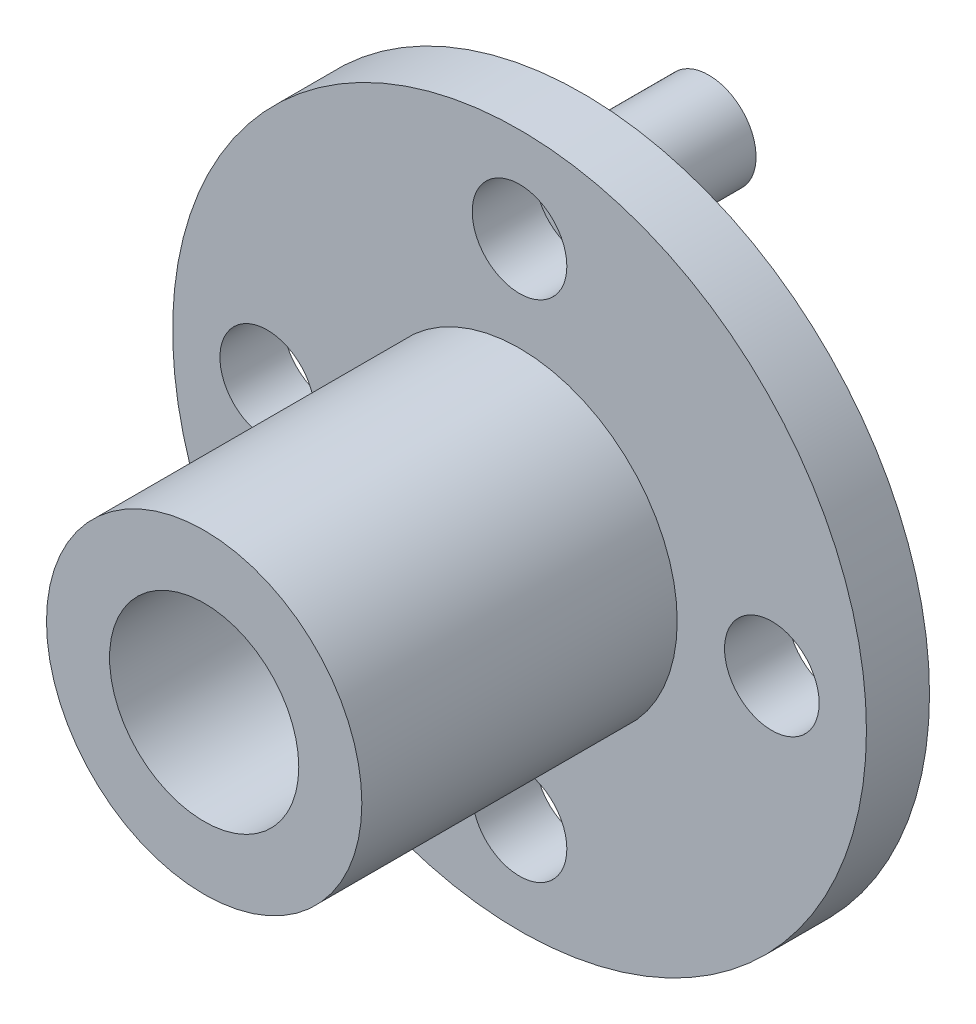
ISO-10303-21;
HEADER;
FILE_DESCRIPTION(('STEP AP214'),'2;1');
FILE_NAME('part.step','',(''),(''),'','','');
FILE_SCHEMA(('AUTOMOTIVE_DESIGN { 1 0 10303 214 1 1 1 1 }'));
ENDSEC;
DATA;
#1=APPLICATION_CONTEXT('core data for automotive mechanical design processes');
#2=APPLICATION_PROTOCOL_DEFINITION('international standard','automotive_design',2000,#1);
#3=PRODUCT_CONTEXT('',#1,'mechanical');
#4=PRODUCT('Part','Part','',(#3));
#5=PRODUCT_RELATED_PRODUCT_CATEGORY('part','',(#4));
#6=PRODUCT_DEFINITION_FORMATION('','',#4);
#7=PRODUCT_DEFINITION_CONTEXT('part definition',#1,'design');
#8=PRODUCT_DEFINITION('design','',#6,#7);
#9=PRODUCT_DEFINITION_SHAPE('','',#8);
#10=(LENGTH_UNIT() NAMED_UNIT(*) SI_UNIT(.MILLI.,.METRE.));
#11=(NAMED_UNIT(*) PLANE_ANGLE_UNIT() SI_UNIT($,.RADIAN.));
#12=(NAMED_UNIT(*) SI_UNIT($,.STERADIAN.) SOLID_ANGLE_UNIT());
#13=UNCERTAINTY_MEASURE_WITH_UNIT(LENGTH_MEASURE(1.E-05),#10,'distance_accuracy_value','');
#14=(GEOMETRIC_REPRESENTATION_CONTEXT(3) GLOBAL_UNCERTAINTY_ASSIGNED_CONTEXT((#13)) GLOBAL_UNIT_ASSIGNED_CONTEXT((#10,
#11,#12)) REPRESENTATION_CONTEXT('',''));
#15=CARTESIAN_POINT('',(0.,0.,0.));
#16=DIRECTION('',(0.,0.,1.));
#17=DIRECTION('',(1.,0.,0.));
#18=AXIS2_PLACEMENT_3D('',#15,#16,#17);
#19=CARTESIAN_POINT('',(0.,8.,-4.));
#20=DIRECTION('',(0.,0.,1.));
#21=DIRECTION('',(1.,0.,0.));
#22=AXIS2_PLACEMENT_3D('',#19,#20,#21);
#23=CYLINDRICAL_SURFACE('',#22,1.5);
#24=CARTESIAN_POINT('',(0.,8.,-4.));
#25=DIRECTION('',(0.,0.,-1.));
#26=DIRECTION('',(-1.,0.,0.));
#27=AXIS2_PLACEMENT_3D('',#24,#25,#26);
#28=CIRCLE('',#27,1.5);
#29=CARTESIAN_POINT('',(-1.49999999999997,8.,-4.));
#30=VERTEX_POINT('',#29);
#31=EDGE_CURVE('E11',#30,#30,#28,.T.);
#32=ORIENTED_EDGE('',*,*,#31,.F.);
#33=EDGE_LOOP('',(#32));
#34=FACE_BOUND('',#33,.T.);
#35=CARTESIAN_POINT('',(0.,8.,0.));
#36=DIRECTION('',(0.,0.,-1.));
#37=DIRECTION('',(-1.,0.,0.));
#38=AXIS2_PLACEMENT_3D('',#35,#36,#37);
#39=CIRCLE('',#38,1.5);
#40=CARTESIAN_POINT('',(-1.49999999999997,8.,0.));
#41=VERTEX_POINT('',#40);
#42=EDGE_CURVE('E48',#41,#41,#39,.T.);
#43=ORIENTED_EDGE('',*,*,#42,.T.);
#44=EDGE_LOOP('',(#43));
#45=FACE_BOUND('',#44,.T.);
#46=ADVANCED_FACE('F45',(#34,#45),#23,.T.);
#47=CARTESIAN_POINT('',(0.,8.,-4.));
#48=DIRECTION('',(0.,0.,-1.));
#49=DIRECTION('',(-1.,0.,0.));
#50=AXIS2_PLACEMENT_3D('',#47,#48,#49);
#51=PLANE('',#50);
#52=ORIENTED_EDGE('',*,*,#31,.T.);
#53=EDGE_LOOP('',(#52));
#54=FACE_BOUND('',#53,.T.);
#55=ADVANCED_FACE('F60',(#54),#51,.T.);
#56=CARTESIAN_POINT('',(0.,8.,0.));
#57=DIRECTION('',(0.,0.,-1.));
#58=DIRECTION('',(-1.,0.,0.));
#59=AXIS2_PLACEMENT_3D('',#56,#57,#58);
#60=PLANE('',#59);
#61=ORIENTED_EDGE('',*,*,#42,.F.);
#62=EDGE_LOOP('',(#61));
#63=FACE_BOUND('',#62,.T.);
#64=ADVANCED_FACE('F58',(#63),#60,.F.);
#65=CLOSED_SHELL('',(#46,#55,#64));
#66=MANIFOLD_SOLID_BREP('B2',#65);
#67=CARTESIAN_POINT('',(0.,0.,2.));
#68=DIRECTION('',(0.,0.,-1.));
#69=DIRECTION('',(-1.,0.,0.));
#70=AXIS2_PLACEMENT_3D('',#67,#68,#69);
#71=CYLINDRICAL_SURFACE('',#70,11.);
#72=CARTESIAN_POINT('',(0.,0.,2.));
#73=DIRECTION('',(0.,0.,1.));
#74=DIRECTION('',(1.,0.,0.));
#75=AXIS2_PLACEMENT_3D('',#72,#73,#74);
#76=CIRCLE('',#75,11.);
#77=CARTESIAN_POINT('',(11.,0.,2.));
#78=VERTEX_POINT('',#77);
#79=EDGE_CURVE('E98',#78,#78,#76,.T.);
#80=ORIENTED_EDGE('',*,*,#79,.F.);
#81=EDGE_LOOP('',(#80));
#82=FACE_BOUND('',#81,.T.);
#83=CARTESIAN_POINT('',(0.,0.,0.));
#84=DIRECTION('',(0.,0.,1.));
#85=DIRECTION('',(1.,0.,0.));
#86=AXIS2_PLACEMENT_3D('',#83,#84,#85);
#87=CIRCLE('',#86,11.);
#88=CARTESIAN_POINT('',(11.,0.,0.));
#89=VERTEX_POINT('',#88);
#90=EDGE_CURVE('E94',#89,#89,#87,.T.);
#91=ORIENTED_EDGE('',*,*,#90,.T.);
#92=EDGE_LOOP('',(#91));
#93=FACE_BOUND('',#92,.T.);
#94=ADVANCED_FACE('F91',(#82,#93),#71,.T.);
#95=CARTESIAN_POINT('',(0.,0.,2.));
#96=DIRECTION('',(0.,0.,1.));
#97=DIRECTION('',(1.,0.,0.));
#98=AXIS2_PLACEMENT_3D('',#95,#96,#97);
#99=PLANE('',#98);
#100=CARTESIAN_POINT('',(-8.,0.,2.));
#101=DIRECTION('',(0.,0.,1.));
#102=DIRECTION('',(1.,0.,0.));
#103=AXIS2_PLACEMENT_3D('',#100,#101,#102);
#104=CIRCLE('',#103,1.5);
#105=CARTESIAN_POINT('',(-6.5,0.,2.));
#106=VERTEX_POINT('',#105);
#107=EDGE_CURVE('E130',#106,#106,#104,.T.);
#108=ORIENTED_EDGE('',*,*,#107,.F.);
#109=EDGE_LOOP('',(#108));
#110=FACE_BOUND('',#109,.T.);
#111=CARTESIAN_POINT('',(0.,8.,2.));
#112=DIRECTION('',(0.,0.,1.));
#113=DIRECTION('',(1.,0.,0.));
#114=AXIS2_PLACEMENT_3D('',#111,#112,#113);
#115=CIRCLE('',#114,1.5);
#116=CARTESIAN_POINT('',(1.50000000000003,8.,2.));
#117=VERTEX_POINT('',#116);
#118=EDGE_CURVE('E124',#117,#117,#115,.T.);
#119=ORIENTED_EDGE('',*,*,#118,.F.);
#120=EDGE_LOOP('',(#119));
#121=FACE_BOUND('',#120,.T.);
#122=CARTESIAN_POINT('',(8.,0.,2.));
#123=DIRECTION('',(0.,0.,1.));
#124=DIRECTION('',(1.,0.,0.));
#125=AXIS2_PLACEMENT_3D('',#122,#123,#124);
#126=CIRCLE('',#125,1.5);
#127=CARTESIAN_POINT('',(9.5,0.,2.));
#128=VERTEX_POINT('',#127);
#129=EDGE_CURVE('E117',#128,#128,#126,.T.);
#130=ORIENTED_EDGE('',*,*,#129,.F.);
#131=EDGE_LOOP('',(#130));
#132=FACE_BOUND('',#131,.T.);
#133=CARTESIAN_POINT('',(0.,-8.,2.));
#134=DIRECTION('',(0.,0.,1.));
#135=DIRECTION('',(1.,0.,0.));
#136=AXIS2_PLACEMENT_3D('',#133,#134,#135);
#137=CIRCLE('',#136,1.5);
#138=CARTESIAN_POINT('',(1.49999999999992,-8.,2.));
#139=VERTEX_POINT('',#138);
#140=EDGE_CURVE('E118',#139,#139,#137,.T.);
#141=ORIENTED_EDGE('',*,*,#140,.F.);
#142=EDGE_LOOP('',(#141));
#143=FACE_BOUND('',#142,.T.);
#144=CARTESIAN_POINT('',(0.,0.,2.));
#145=DIRECTION('',(0.,0.,1.));
#146=DIRECTION('',(1.,0.,0.));
#147=AXIS2_PLACEMENT_3D('',#144,#145,#146);
#148=CIRCLE('',#147,5.);
#149=CARTESIAN_POINT('',(5.,0.,2.));
#150=VERTEX_POINT('',#149);
#151=EDGE_CURVE('E44',#150,#150,#148,.T.);
#152=ORIENTED_EDGE('',*,*,#151,.F.);
#153=EDGE_LOOP('',(#152));
#154=FACE_BOUND('',#153,.T.);
#155=ORIENTED_EDGE('',*,*,#79,.T.);
#156=EDGE_LOOP('',(#155));
#157=FACE_BOUND('',#156,.T.);
#158=ADVANCED_FACE('F141',(#110,#121,#132,#143,#154,#157),#99,.T.);
#159=CARTESIAN_POINT('',(0.,0.,0.));
#160=DIRECTION('',(0.,0.,1.));
#161=DIRECTION('',(1.,0.,0.));
#162=AXIS2_PLACEMENT_3D('',#159,#160,#161);
#163=PLANE('',#162);
#164=CARTESIAN_POINT('',(-8.,0.,0.));
#165=DIRECTION('',(0.,0.,1.));
#166=DIRECTION('',(1.,0.,0.));
#167=AXIS2_PLACEMENT_3D('',#164,#165,#166);
#168=CIRCLE('',#167,1.5);
#169=CARTESIAN_POINT('',(-6.5,0.,0.));
#170=VERTEX_POINT('',#169);
#171=EDGE_CURVE('E111',#170,#170,#168,.F.);
#172=ORIENTED_EDGE('',*,*,#171,.F.);
#173=EDGE_LOOP('',(#172));
#174=FACE_BOUND('',#173,.T.);
#175=CARTESIAN_POINT('',(0.,8.,0.));
#176=DIRECTION('',(0.,0.,1.));
#177=DIRECTION('',(1.,0.,0.));
#178=AXIS2_PLACEMENT_3D('',#175,#176,#177);
#179=CIRCLE('',#178,1.5);
#180=CARTESIAN_POINT('',(1.50000000000003,8.,0.));
#181=VERTEX_POINT('',#180);
#182=EDGE_CURVE('E127',#181,#181,#179,.F.);
#183=ORIENTED_EDGE('',*,*,#182,.F.);
#184=EDGE_LOOP('',(#183));
#185=FACE_BOUND('',#184,.T.);
#186=CARTESIAN_POINT('',(8.,0.,0.));
#187=DIRECTION('',(0.,0.,1.));
#188=DIRECTION('',(1.,0.,0.));
#189=AXIS2_PLACEMENT_3D('',#186,#187,#188);
#190=CIRCLE('',#189,1.5);
#191=CARTESIAN_POINT('',(9.5,0.,0.));
#192=VERTEX_POINT('',#191);
#193=EDGE_CURVE('E121',#192,#192,#190,.F.);
#194=ORIENTED_EDGE('',*,*,#193,.F.);
#195=EDGE_LOOP('',(#194));
#196=FACE_BOUND('',#195,.T.);
#197=CARTESIAN_POINT('',(0.,-8.,0.));
#198=DIRECTION('',(0.,0.,1.));
#199=DIRECTION('',(1.,0.,0.));
#200=AXIS2_PLACEMENT_3D('',#197,#198,#199);
#201=CIRCLE('',#200,1.5);
#202=CARTESIAN_POINT('',(1.49999999999992,-8.,0.));
#203=VERTEX_POINT('',#202);
#204=EDGE_CURVE('E114',#203,#203,#201,.F.);
#205=ORIENTED_EDGE('',*,*,#204,.F.);
#206=EDGE_LOOP('',(#205));
#207=FACE_BOUND('',#206,.T.);
#208=CARTESIAN_POINT('',(0.,0.,0.));
#209=DIRECTION('',(0.,0.,1.));
#210=DIRECTION('',(1.,0.,0.));
#211=AXIS2_PLACEMENT_3D('',#208,#209,#210);
#212=CIRCLE('',#211,3.);
#213=CARTESIAN_POINT('',(3.,0.,0.));
#214=VERTEX_POINT('',#213);
#215=EDGE_CURVE('E107',#214,#214,#212,.T.);
#216=ORIENTED_EDGE('',*,*,#215,.T.);
#217=EDGE_LOOP('',(#216));
#218=FACE_BOUND('',#217,.T.);
#219=ORIENTED_EDGE('',*,*,#90,.F.);
#220=EDGE_LOOP('',(#219));
#221=FACE_BOUND('',#220,.T.);
#222=ADVANCED_FACE('F144',(#174,#185,#196,#207,#218,#221),#163,.F.);
#223=CARTESIAN_POINT('',(0.,0.,12.));
#224=DIRECTION('',(0.,0.,-1.));
#225=DIRECTION('',(-1.,0.,0.));
#226=AXIS2_PLACEMENT_3D('',#223,#224,#225);
#227=CYLINDRICAL_SURFACE('',#226,5.);
#228=CARTESIAN_POINT('',(0.,0.,12.));
#229=DIRECTION('',(0.,0.,1.));
#230=DIRECTION('',(1.,0.,0.));
#231=AXIS2_PLACEMENT_3D('',#228,#229,#230);
#232=CIRCLE('',#231,5.);
#233=CARTESIAN_POINT('',(5.,0.,12.));
#234=VERTEX_POINT('',#233);
#235=EDGE_CURVE('E104',#234,#234,#232,.T.);
#236=ORIENTED_EDGE('',*,*,#235,.F.);
#237=EDGE_LOOP('',(#236));
#238=FACE_BOUND('',#237,.T.);
#239=ORIENTED_EDGE('',*,*,#151,.T.);
#240=EDGE_LOOP('',(#239));
#241=FACE_BOUND('',#240,.T.);
#242=ADVANCED_FACE('F161',(#238,#241),#227,.T.);
#243=CARTESIAN_POINT('',(0.,0.,12.));
#244=DIRECTION('',(0.,0.,1.));
#245=DIRECTION('',(1.,0.,0.));
#246=AXIS2_PLACEMENT_3D('',#243,#244,#245);
#247=PLANE('',#246);
#248=CARTESIAN_POINT('',(0.,0.,12.));
#249=DIRECTION('',(0.,0.,1.));
#250=DIRECTION('',(1.,0.,0.));
#251=AXIS2_PLACEMENT_3D('',#248,#249,#250);
#252=CIRCLE('',#251,3.);
#253=CARTESIAN_POINT('',(3.,0.,12.));
#254=VERTEX_POINT('',#253);
#255=EDGE_CURVE('E108',#254,#254,#252,.T.);
#256=ORIENTED_EDGE('',*,*,#255,.F.);
#257=EDGE_LOOP('',(#256));
#258=FACE_BOUND('',#257,.T.);
#259=ORIENTED_EDGE('',*,*,#235,.T.);
#260=EDGE_LOOP('',(#259));
#261=FACE_BOUND('',#260,.T.);
#262=ADVANCED_FACE('F166',(#258,#261),#247,.T.);
#263=CARTESIAN_POINT('',(0.,0.,0.));
#264=DIRECTION('',(0.,0.,1.));
#265=DIRECTION('',(1.,0.,0.));
#266=AXIS2_PLACEMENT_3D('',#263,#264,#265);
#267=CYLINDRICAL_SURFACE('',#266,3.);
#268=ORIENTED_EDGE('',*,*,#215,.F.);
#269=EDGE_LOOP('',(#268));
#270=FACE_BOUND('',#269,.T.);
#271=ORIENTED_EDGE('',*,*,#255,.T.);
#272=EDGE_LOOP('',(#271));
#273=FACE_BOUND('',#272,.T.);
#274=ADVANCED_FACE('F174',(#270,#273),#267,.F.);
#275=CARTESIAN_POINT('',(0.,-8.,-0.00100000000000013));
#276=DIRECTION('',(0.,0.,1.));
#277=DIRECTION('',(1.,0.,0.));
#278=AXIS2_PLACEMENT_3D('',#275,#276,#277);
#279=CYLINDRICAL_SURFACE('',#278,1.5);
#280=ORIENTED_EDGE('',*,*,#140,.T.);
#281=EDGE_LOOP('',(#280));
#282=FACE_BOUND('',#281,.T.);
#283=ORIENTED_EDGE('',*,*,#204,.T.);
#284=EDGE_LOOP('',(#283));
#285=FACE_BOUND('',#284,.T.);
#286=ADVANCED_FACE('F178',(#282,#285),#279,.F.);
#287=CARTESIAN_POINT('',(8.,0.,-0.00100000000000013));
#288=DIRECTION('',(0.,0.,1.));
#289=DIRECTION('',(1.,0.,0.));
#290=AXIS2_PLACEMENT_3D('',#287,#288,#289);
#291=CYLINDRICAL_SURFACE('',#290,1.5);
#292=ORIENTED_EDGE('',*,*,#129,.T.);
#293=EDGE_LOOP('',(#292));
#294=FACE_BOUND('',#293,.T.);
#295=ORIENTED_EDGE('',*,*,#193,.T.);
#296=EDGE_LOOP('',(#295));
#297=FACE_BOUND('',#296,.T.);
#298=ADVANCED_FACE('F182',(#294,#297),#291,.F.);
#299=CARTESIAN_POINT('',(0.,8.,-0.00100000000000013));
#300=DIRECTION('',(0.,0.,1.));
#301=DIRECTION('',(1.,0.,0.));
#302=AXIS2_PLACEMENT_3D('',#299,#300,#301);
#303=CYLINDRICAL_SURFACE('',#302,1.5);
#304=ORIENTED_EDGE('',*,*,#118,.T.);
#305=EDGE_LOOP('',(#304));
#306=FACE_BOUND('',#305,.T.);
#307=ORIENTED_EDGE('',*,*,#182,.T.);
#308=EDGE_LOOP('',(#307));
#309=FACE_BOUND('',#308,.T.);
#310=ADVANCED_FACE('F186',(#306,#309),#303,.F.);
#311=CARTESIAN_POINT('',(-8.,0.,-0.00100000000000013));
#312=DIRECTION('',(0.,0.,1.));
#313=DIRECTION('',(1.,0.,0.));
#314=AXIS2_PLACEMENT_3D('',#311,#312,#313);
#315=CYLINDRICAL_SURFACE('',#314,1.5);
#316=ORIENTED_EDGE('',*,*,#107,.T.);
#317=EDGE_LOOP('',(#316));
#318=FACE_BOUND('',#317,.T.);
#319=ORIENTED_EDGE('',*,*,#171,.T.);
#320=EDGE_LOOP('',(#319));
#321=FACE_BOUND('',#320,.T.);
#322=ADVANCED_FACE('F138',(#318,#321),#315,.F.);
#323=CLOSED_SHELL('',(#94,#158,#222,#242,#262,#274,#286,#298,#310,#322));
#324=MANIFOLD_SOLID_BREP('B6',#323);
#325=ADVANCED_BREP_SHAPE_REPRESENTATION('',(#18,#66,#324),#14);
#326=SHAPE_DEFINITION_REPRESENTATION(#9,#325);
ENDSEC;
END-ISO-10303-21;
